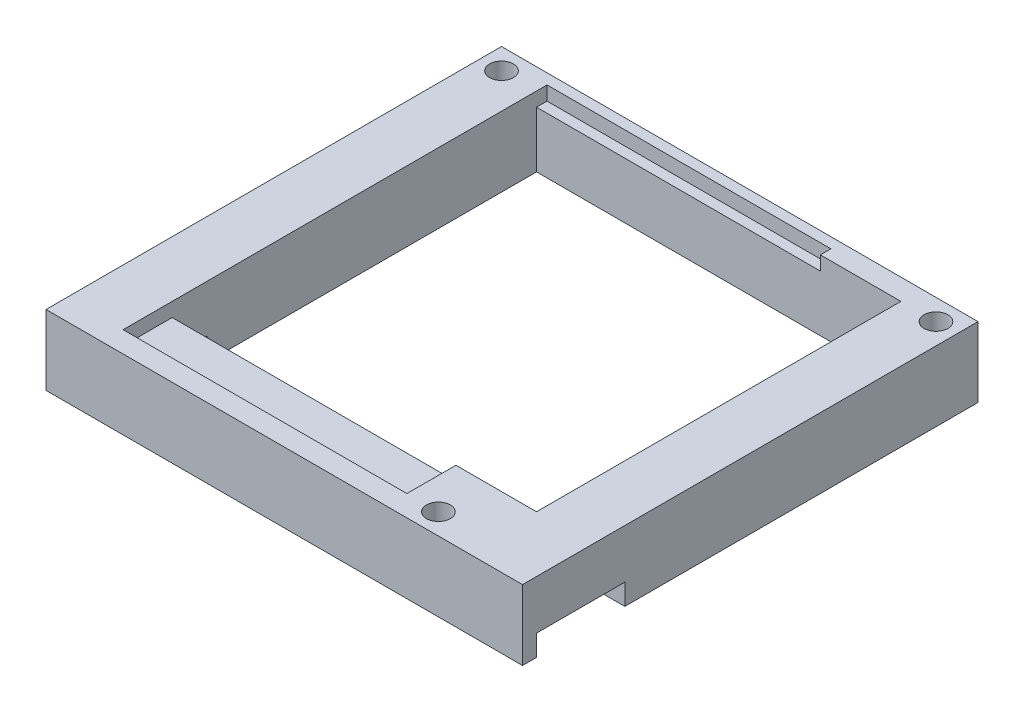
ISO-10303-21;
HEADER;
FILE_DESCRIPTION(('STEP AP214'),'2;1');
FILE_NAME('part.step','',(''),(''),'','','');
FILE_SCHEMA(('AUTOMOTIVE_DESIGN { 1 0 10303 214 1 1 1 1 }'));
ENDSEC;
DATA;
#1=APPLICATION_CONTEXT('core data for automotive mechanical design processes');
#2=APPLICATION_PROTOCOL_DEFINITION('international standard','automotive_design',2000,#1);
#3=PRODUCT_CONTEXT('',#1,'mechanical');
#4=PRODUCT('Part','Part','',(#3));
#5=PRODUCT_RELATED_PRODUCT_CATEGORY('part','',(#4));
#6=PRODUCT_DEFINITION_FORMATION('','',#4);
#7=PRODUCT_DEFINITION_CONTEXT('part definition',#1,'design');
#8=PRODUCT_DEFINITION('design','',#6,#7);
#9=PRODUCT_DEFINITION_SHAPE('','',#8);
#10=(LENGTH_UNIT() NAMED_UNIT(*) SI_UNIT(.MILLI.,.METRE.));
#11=(NAMED_UNIT(*) PLANE_ANGLE_UNIT() SI_UNIT($,.RADIAN.));
#12=(NAMED_UNIT(*) SI_UNIT($,.STERADIAN.) SOLID_ANGLE_UNIT());
#13=UNCERTAINTY_MEASURE_WITH_UNIT(LENGTH_MEASURE(1.E-05),#10,'distance_accuracy_value','');
#14=(GEOMETRIC_REPRESENTATION_CONTEXT(3) GLOBAL_UNCERTAINTY_ASSIGNED_CONTEXT((#13)) GLOBAL_UNIT_ASSIGNED_CONTEXT((#10,
#11,#12)) REPRESENTATION_CONTEXT('',''));
#15=CARTESIAN_POINT('',(0.,0.,0.));
#16=DIRECTION('',(0.,0.,1.));
#17=DIRECTION('',(1.,0.,0.));
#18=AXIS2_PLACEMENT_3D('',#15,#16,#17);
#19=CARTESIAN_POINT('',(-39.6988745927811,7.84894881770015,90.4869749490172));
#20=DIRECTION('',(0.,-1.,0.));
#21=DIRECTION('',(0.,0.,-1.));
#22=AXIS2_PLACEMENT_3D('',#19,#20,#21);
#23=PLANE('',#22);
#24=DIRECTION('',(1.,0.,0.));
#25=VECTOR('',#24,1.);
#26=CARTESIAN_POINT('',(28.3011254072189,7.84894881770015,75.8869749490172));
#27=LINE('',#26,#25);
#28=CARTESIAN_POINT('',(20.3011254072189,7.84894881770015,75.8869749490172));
#29=VERTEX_POINT('',#28);
#30=CARTESIAN_POINT('',(28.3011254072189,7.84894881770015,75.8869749490172));
#31=VERTEX_POINT('',#30);
#32=EDGE_CURVE('E228',#29,#31,#27,.T.);
#33=ORIENTED_EDGE('',*,*,#32,.F.);
#34=DIRECTION('',(0.,0.,-1.));
#35=VECTOR('',#34,1.);
#36=CARTESIAN_POINT('',(20.3011254072189,7.84894881770015,80.4869749490172));
#37=LINE('',#36,#35);
#38=CARTESIAN_POINT('',(20.3011254072189,7.84894881770015,28.4869749490172));
#39=VERTEX_POINT('',#38);
#40=EDGE_CURVE('E384',#29,#39,#37,.T.);
#41=ORIENTED_EDGE('',*,*,#40,.T.);
#42=DIRECTION('',(-1.,0.,0.));
#43=VECTOR('',#42,1.);
#44=CARTESIAN_POINT('',(-31.6988745927811,7.84894881770015,28.4869749490172));
#45=LINE('',#44,#43);
#46=CARTESIAN_POINT('',(-31.6988745927811,7.84894881770015,28.4869749490172));
#47=VERTEX_POINT('',#46);
#48=EDGE_CURVE('E370',#39,#47,#45,.T.);
#49=ORIENTED_EDGE('',*,*,#48,.T.);
#50=DIRECTION('',(0.,0.,1.));
#51=VECTOR('',#50,1.);
#52=CARTESIAN_POINT('',(-31.6988745927811,7.84894881770015,80.4869749490172));
#53=LINE('',#52,#51);
#54=CARTESIAN_POINT('',(-31.6988745927811,7.84894881770015,75.4869749490172));
#55=VERTEX_POINT('',#54);
#56=EDGE_CURVE('E366',#47,#55,#53,.T.);
#57=ORIENTED_EDGE('',*,*,#56,.T.);
#58=DIRECTION('',(-1.,0.,0.));
#59=VECTOR('',#58,1.);
#60=CARTESIAN_POINT('',(-3.69887459278107,7.84894881770015,75.4869749490172));
#61=LINE('',#60,#59);
#62=CARTESIAN_POINT('',(-33.6988745927811,7.84894881770015,75.4869749490172));
#63=VERTEX_POINT('',#62);
#64=EDGE_CURVE('E254',#55,#63,#61,.T.);
#65=ORIENTED_EDGE('',*,*,#64,.T.);
#66=DIRECTION('',(0.,0.,1.));
#67=VECTOR('',#66,1.);
#68=CARTESIAN_POINT('',(-33.6988745927811,7.84894881770015,74.4869749490172));
#69=LINE('',#68,#67);
#70=CARTESIAN_POINT('',(-33.6988745927811,7.84894881770015,74.4869749490172));
#71=VERTEX_POINT('',#70);
#72=EDGE_CURVE('E268',#71,#63,#69,.T.);
#73=ORIENTED_EDGE('',*,*,#72,.F.);
#74=DIRECTION('',(-1.,0.,0.));
#75=VECTOR('',#74,1.);
#76=CARTESIAN_POINT('',(-33.6988745927811,7.84894881770015,74.4869749490172));
#77=LINE('',#76,#75);
#78=CARTESIAN_POINT('',(-39.6988745927811,7.84894881770015,74.4869749490172));
#79=VERTEX_POINT('',#78);
#80=EDGE_CURVE('E298',#71,#79,#77,.T.);
#81=ORIENTED_EDGE('',*,*,#80,.T.);
#82=DIRECTION('',(0.,0.,1.));
#83=VECTOR('',#82,1.);
#84=CARTESIAN_POINT('',(-39.6988745927811,7.84894881770015,90.4869749490172));
#85=LINE('',#84,#83);
#86=CARTESIAN_POINT('',(-39.6988745927811,7.84894881770015,25.4869749490172));
#87=VERTEX_POINT('',#86);
#88=EDGE_CURVE('E410',#87,#79,#85,.T.);
#89=ORIENTED_EDGE('',*,*,#88,.F.);
#90=DIRECTION('',(-1.,0.,0.));
#91=VECTOR('',#90,1.);
#92=CARTESIAN_POINT('',(-39.6988745927811,7.84894881770015,25.4869749490172));
#93=LINE('',#92,#91);
#94=CARTESIAN_POINT('',(28.3011254072189,7.84894881770015,25.4869749490172));
#95=VERTEX_POINT('',#94);
#96=EDGE_CURVE('E403',#95,#87,#93,.T.);
#97=ORIENTED_EDGE('',*,*,#96,.F.);
#98=DIRECTION('',(0.,0.,-1.));
#99=VECTOR('',#98,1.);
#100=CARTESIAN_POINT('',(28.3011254072189,7.84894881770015,90.4869749490172));
#101=LINE('',#100,#99);
#102=EDGE_CURVE('E415',#31,#95,#101,.T.);
#103=ORIENTED_EDGE('',*,*,#102,.F.);
#104=EDGE_LOOP('',(#33,#41,#49,#57,#65,#73,#81,#89,#97,#103));
#105=FACE_BOUND('',#104,.T.);
#106=CARTESIAN_POINT('',(25.3011254072189,7.84894881770015,28.4869749490172));
#107=DIRECTION('',(0.,1.,0.));
#108=DIRECTION('',(0.,0.,1.));
#109=AXIS2_PLACEMENT_3D('',#106,#107,#108);
#110=CIRCLE('',#109,1.7);
#111=CARTESIAN_POINT('',(25.3011254072189,7.84894881770015,30.1869749490172));
#112=VERTEX_POINT('',#111);
#113=EDGE_CURVE('E318',#112,#112,#110,.T.);
#114=ORIENTED_EDGE('',*,*,#113,.T.);
#115=EDGE_LOOP('',(#114));
#116=FACE_BOUND('',#115,.T.);
#117=CARTESIAN_POINT('',(-36.6988745927811,7.84894881770015,28.4869749490172));
#118=DIRECTION('',(0.,1.,0.));
#119=DIRECTION('',(0.,0.,1.));
#120=AXIS2_PLACEMENT_3D('',#117,#118,#119);
#121=CIRCLE('',#120,1.70000000000001);
#122=CARTESIAN_POINT('',(-36.6988745927811,7.84894881770015,30.1869749490172));
#123=VERTEX_POINT('',#122);
#124=EDGE_CURVE('E311',#123,#123,#121,.T.);
#125=ORIENTED_EDGE('',*,*,#124,.T.);
#126=EDGE_LOOP('',(#125));
#127=FACE_BOUND('',#126,.T.);
#128=ADVANCED_FACE('F16',(#105,#116,#127),#23,.T.);
#129=CARTESIAN_POINT('',(-33.6988745927811,7.84894881770015,90.4869749490172));
#130=DIRECTION('',(-1.,0.,0.));
#131=DIRECTION('',(0.,0.,1.));
#132=AXIS2_PLACEMENT_3D('',#129,#130,#131);
#133=PLANE('',#132);
#134=DIRECTION('',(0.,-1.,0.));
#135=VECTOR('',#134,1.);
#136=CARTESIAN_POINT('',(-33.6988745927811,7.84894881770015,75.4869749490172));
#137=LINE('',#136,#135);
#138=CARTESIAN_POINT('',(-33.6988745927811,11.0989488177001,75.4869749490172));
#139=VERTEX_POINT('',#138);
#140=EDGE_CURVE('E251',#139,#63,#137,.T.);
#141=ORIENTED_EDGE('',*,*,#140,.F.);
#142=DIRECTION('',(0.,0.,-1.));
#143=VECTOR('',#142,1.);
#144=CARTESIAN_POINT('',(-33.6988745927811,11.0989488177001,81.5869749490172));
#145=LINE('',#144,#143);
#146=CARTESIAN_POINT('',(-33.6988745927811,11.0989488177001,74.4869749490172));
#147=VERTEX_POINT('',#146);
#148=EDGE_CURVE('E280',#139,#147,#145,.T.);
#149=ORIENTED_EDGE('',*,*,#148,.T.);
#150=DIRECTION('',(0.,-1.,0.));
#151=VECTOR('',#150,1.);
#152=CARTESIAN_POINT('',(-33.6988745927811,11.0989488177001,74.4869749490172));
#153=LINE('',#152,#151);
#154=EDGE_CURVE('E282',#147,#71,#153,.T.);
#155=ORIENTED_EDGE('',*,*,#154,.T.);
#156=ORIENTED_EDGE('',*,*,#72,.T.);
#157=EDGE_LOOP('',(#141,#149,#155,#156));
#158=FACE_BOUND('',#157,.T.);
#159=ADVANCED_FACE('F517',(#158),#133,.T.);
#160=CARTESIAN_POINT('',(-39.6988745927811,17.8489488177001,90.4869749490172));
#161=DIRECTION('',(0.,-1.,0.));
#162=DIRECTION('',(0.,0.,-1.));
#163=AXIS2_PLACEMENT_3D('',#160,#161,#162);
#164=PLANE('',#163);
#165=CARTESIAN_POINT('',(-36.6988745927811,17.8489488177001,28.4869749490172));
#166=DIRECTION('',(0.,1.,0.));
#167=DIRECTION('',(0.,0.,1.));
#168=AXIS2_PLACEMENT_3D('',#165,#166,#167);
#169=CIRCLE('',#168,1.70000000000001);
#170=CARTESIAN_POINT('',(-36.6988745927811,17.8489488177001,30.1869749490172));
#171=VERTEX_POINT('',#170);
#172=EDGE_CURVE('E315',#171,#171,#169,.T.);
#173=ORIENTED_EDGE('',*,*,#172,.F.);
#174=EDGE_LOOP('',(#173));
#175=FACE_BOUND('',#174,.T.);
#176=CARTESIAN_POINT('',(25.3011254072189,17.8489488177001,28.4869749490172));
#177=DIRECTION('',(0.,1.,0.));
#178=DIRECTION('',(0.,0.,1.));
#179=AXIS2_PLACEMENT_3D('',#176,#177,#178);
#180=CIRCLE('',#179,1.7);
#181=CARTESIAN_POINT('',(25.3011254072189,17.8489488177001,30.1869749490172));
#182=VERTEX_POINT('',#181);
#183=EDGE_CURVE('E321',#182,#182,#180,.T.);
#184=ORIENTED_EDGE('',*,*,#183,.F.);
#185=EDGE_LOOP('',(#184));
#186=FACE_BOUND('',#185,.T.);
#187=CARTESIAN_POINT('',(13.3011254072189,17.8489488177001,87.4869749490172));
#188=DIRECTION('',(0.,1.,0.));
#189=DIRECTION('',(0.,0.,1.));
#190=AXIS2_PLACEMENT_3D('',#187,#188,#189);
#191=CIRCLE('',#190,1.7);
#192=CARTESIAN_POINT('',(13.3011254072189,17.8489488177001,89.1869749490172));
#193=VERTEX_POINT('',#192);
#194=EDGE_CURVE('E301',#193,#193,#191,.T.);
#195=ORIENTED_EDGE('',*,*,#194,.F.);
#196=EDGE_LOOP('',(#195));
#197=FACE_BOUND('',#196,.T.);
#198=DIRECTION('',(0.,0.,1.));
#199=VECTOR('',#198,1.);
#200=CARTESIAN_POINT('',(-39.6988745927811,17.8489488177001,90.4869749490172));
#201=LINE('',#200,#199);
#202=CARTESIAN_POINT('',(-39.6988745927811,17.8489488177001,25.4869749490172));
#203=VERTEX_POINT('',#202);
#204=CARTESIAN_POINT('',(-39.6988745927811,17.8489488177001,90.4869749490172));
#205=VERTEX_POINT('',#204);
#206=EDGE_CURVE('E399',#203,#205,#201,.T.);
#207=ORIENTED_EDGE('',*,*,#206,.T.);
#208=DIRECTION('',(1.,0.,0.));
#209=VECTOR('',#208,1.);
#210=CARTESIAN_POINT('',(-39.6988745927811,17.8489488177001,90.4869749490172));
#211=LINE('',#210,#209);
#212=CARTESIAN_POINT('',(28.3011254072189,17.8489488177001,90.4869749490172));
#213=VERTEX_POINT('',#212);
#214=EDGE_CURVE('E402',#205,#213,#211,.T.);
#215=ORIENTED_EDGE('',*,*,#214,.T.);
#216=DIRECTION('',(0.,0.,-1.));
#217=VECTOR('',#216,1.);
#218=CARTESIAN_POINT('',(28.3011254072189,17.8489488177001,90.4869749490172));
#219=LINE('',#218,#217);
#220=CARTESIAN_POINT('',(28.3011254072189,17.8489488177001,25.4869749490172));
#221=VERTEX_POINT('',#220);
#222=EDGE_CURVE('E405',#213,#221,#219,.T.);
#223=ORIENTED_EDGE('',*,*,#222,.T.);
#224=DIRECTION('',(-1.,0.,0.));
#225=VECTOR('',#224,1.);
#226=CARTESIAN_POINT('',(-39.6988745927811,17.8489488177001,25.4869749490172));
#227=LINE('',#226,#225);
#228=EDGE_CURVE('E407',#221,#203,#227,.T.);
#229=ORIENTED_EDGE('',*,*,#228,.T.);
#230=EDGE_LOOP('',(#207,#215,#223,#229));
#231=FACE_BOUND('',#230,.T.);
#232=DIRECTION('',(0.,0.,1.));
#233=VECTOR('',#232,1.);
#234=CARTESIAN_POINT('',(-31.6988745927811,17.8489488177001,80.4869749490172));
#235=LINE('',#234,#233);
#236=CARTESIAN_POINT('',(-31.6988745927811,17.8489488177001,26.9869749490172));
#237=VERTEX_POINT('',#236);
#238=CARTESIAN_POINT('',(-31.6988745927811,17.8489488177001,87.4869749490172));
#239=VERTEX_POINT('',#238);
#240=EDGE_CURVE('E367',#237,#239,#235,.T.);
#241=ORIENTED_EDGE('',*,*,#240,.F.);
#242=DIRECTION('',(-1.,0.,0.));
#243=VECTOR('',#242,1.);
#244=CARTESIAN_POINT('',(-31.6988745927811,17.8489488177001,26.9869749490172));
#245=LINE('',#244,#243);
#246=CARTESIAN_POINT('',(8.80112540721892,17.8489488177001,26.9869749490172));
#247=VERTEX_POINT('',#246);
#248=EDGE_CURVE('E347',#247,#237,#245,.T.);
#249=ORIENTED_EDGE('',*,*,#248,.F.);
#250=DIRECTION('',(0.,0.,-1.));
#251=VECTOR('',#250,1.);
#252=CARTESIAN_POINT('',(8.80112540721892,17.8489488177001,26.9869749490172));
#253=LINE('',#252,#251);
#254=CARTESIAN_POINT('',(8.80112540721892,17.8489488177001,28.4869749490172));
#255=VERTEX_POINT('',#254);
#256=EDGE_CURVE('E344',#255,#247,#253,.T.);
#257=ORIENTED_EDGE('',*,*,#256,.F.);
#258=DIRECTION('',(-1.,0.,0.));
#259=VECTOR('',#258,1.);
#260=CARTESIAN_POINT('',(-31.6988745927811,17.8489488177001,28.4869749490172));
#261=LINE('',#260,#259);
#262=CARTESIAN_POINT('',(20.3011254072189,17.8489488177001,28.4869749490172));
#263=VERTEX_POINT('',#262);
#264=EDGE_CURVE('E375',#263,#255,#261,.T.);
#265=ORIENTED_EDGE('',*,*,#264,.F.);
#266=DIRECTION('',(0.,0.,-1.));
#267=VECTOR('',#266,1.);
#268=CARTESIAN_POINT('',(20.3011254072189,17.8489488177001,80.4869749490172));
#269=LINE('',#268,#267);
#270=CARTESIAN_POINT('',(20.3011254072189,17.8489488177001,80.4869749490172));
#271=VERTEX_POINT('',#270);
#272=EDGE_CURVE('E372',#271,#263,#269,.T.);
#273=ORIENTED_EDGE('',*,*,#272,.F.);
#274=DIRECTION('',(1.,0.,0.));
#275=VECTOR('',#274,1.);
#276=CARTESIAN_POINT('',(-31.6988745927811,17.8489488177001,80.4869749490172));
#277=LINE('',#276,#275);
#278=CARTESIAN_POINT('',(8.80112540721893,17.8489488177001,80.4869749490172));
#279=VERTEX_POINT('',#278);
#280=EDGE_CURVE('E369',#279,#271,#277,.T.);
#281=ORIENTED_EDGE('',*,*,#280,.F.);
#282=CARTESIAN_POINT('',(8.80112540721893,17.8489488177001,87.4869749490172));
#283=VERTEX_POINT('',#282);
#284=EDGE_CURVE('E345',#283,#279,#253,.T.);
#285=ORIENTED_EDGE('',*,*,#284,.F.);
#286=DIRECTION('',(1.,0.,0.));
#287=VECTOR('',#286,1.);
#288=CARTESIAN_POINT('',(-31.6988745927811,17.8489488177001,87.4869749490172));
#289=LINE('',#288,#287);
#290=EDGE_CURVE('E314',#239,#283,#289,.T.);
#291=ORIENTED_EDGE('',*,*,#290,.F.);
#292=EDGE_LOOP('',(#241,#249,#257,#265,#273,#281,#285,#291));
#293=FACE_BOUND('',#292,.T.);
#294=ADVANCED_FACE('F466',(#175,#186,#197,#231,#293),#164,.F.);
#295=DIRECTION('',(-1.,0.,0.));
#296=VECTOR('',#295,1.);
#297=CARTESIAN_POINT('',(20.3011254072189,7.84894881770015,88.4869749490172));
#298=LINE('',#297,#296);
#299=CARTESIAN_POINT('',(28.3011254072189,7.84894881770015,88.4869749490172));
#300=VERTEX_POINT('',#299);
#301=CARTESIAN_POINT('',(20.3011254072189,7.84894881770015,88.4869749490172));
#302=VERTEX_POINT('',#301);
#303=EDGE_CURVE('E214',#300,#302,#298,.T.);
#304=ORIENTED_EDGE('',*,*,#303,.F.);
#305=CARTESIAN_POINT('',(28.3011254072189,7.84894881770015,90.4869749490172));
#306=VERTEX_POINT('',#305);
#307=EDGE_CURVE('E416',#306,#300,#101,.T.);
#308=ORIENTED_EDGE('',*,*,#307,.F.);
#309=DIRECTION('',(1.,0.,0.));
#310=VECTOR('',#309,1.);
#311=CARTESIAN_POINT('',(-39.6988745927811,7.84894881770015,90.4869749490172));
#312=LINE('',#311,#310);
#313=CARTESIAN_POINT('',(-39.6988745927811,7.84894881770015,90.4869749490172));
#314=VERTEX_POINT('',#313);
#315=EDGE_CURVE('E413',#314,#306,#312,.T.);
#316=ORIENTED_EDGE('',*,*,#315,.F.);
#317=CARTESIAN_POINT('',(-39.6988745927811,7.84894881770015,88.4869749490172));
#318=VERTEX_POINT('',#317);
#319=EDGE_CURVE('E398',#318,#314,#85,.T.);
#320=ORIENTED_EDGE('',*,*,#319,.F.);
#321=DIRECTION('',(-1.,0.,0.));
#322=VECTOR('',#321,1.);
#323=CARTESIAN_POINT('',(-33.6988745927811,7.84894881770015,88.4869749490172));
#324=LINE('',#323,#322);
#325=CARTESIAN_POINT('',(-17.5552810533323,7.84894881770015,88.4869749490172));
#326=VERTEX_POINT('',#325);
#327=EDGE_CURVE('E285',#326,#318,#324,.T.);
#328=ORIENTED_EDGE('',*,*,#327,.F.);
#329=DIRECTION('',(0.866025403784442,0.,-0.499999999999995));
#330=VECTOR('',#329,1.);
#331=CARTESIAN_POINT('',(-3.69887459278107,7.84894881770015,80.4869749490172));
#332=LINE('',#331,#330);
#333=CARTESIAN_POINT('',(-3.69887459278107,7.84894881770015,80.4869749490172));
#334=VERTEX_POINT('',#333);
#335=EDGE_CURVE('E11',#326,#334,#332,.T.);
#336=ORIENTED_EDGE('',*,*,#335,.T.);
#337=DIRECTION('',(1.,0.,0.));
#338=VECTOR('',#337,1.);
#339=CARTESIAN_POINT('',(-31.6988745927811,7.84894881770015,80.4869749490172));
#340=LINE('',#339,#338);
#341=CARTESIAN_POINT('',(12.301125407219,7.84894881770015,80.4869749490172));
#342=VERTEX_POINT('',#341);
#343=EDGE_CURVE('E381',#334,#342,#340,.T.);
#344=ORIENTED_EDGE('',*,*,#343,.T.);
#345=DIRECTION('',(-0.707106781186546,0.,-0.707106781186549));
#346=VECTOR('',#345,1.);
#347=CARTESIAN_POINT('',(12.301125407219,7.84894881770015,80.4869749490172));
#348=LINE('',#347,#346);
#349=EDGE_CURVE('E230',#302,#342,#348,.T.);
#350=ORIENTED_EDGE('',*,*,#349,.F.);
#351=EDGE_LOOP('',(#304,#308,#316,#320,#328,#336,#344,#350));
#352=FACE_BOUND('',#351,.T.);
#353=CARTESIAN_POINT('',(13.3011254072189,7.84894881770015,87.4869749490172));
#354=DIRECTION('',(0.,1.,0.));
#355=DIRECTION('',(0.,0.,1.));
#356=AXIS2_PLACEMENT_3D('',#353,#354,#355);
#357=CIRCLE('',#356,1.7);
#358=CARTESIAN_POINT('',(13.3011254072189,7.84894881770015,89.1869749490172));
#359=VERTEX_POINT('',#358);
#360=EDGE_CURVE('E324',#359,#359,#357,.T.);
#361=ORIENTED_EDGE('',*,*,#360,.T.);
#362=EDGE_LOOP('',(#361));
#363=FACE_BOUND('',#362,.T.);
#364=ADVANCED_FACE('F452',(#352,#363),#23,.T.);
#365=CARTESIAN_POINT('',(-39.6988745927811,17.8489488177001,90.4869749490172));
#366=DIRECTION('',(1.,0.,0.));
#367=DIRECTION('',(0.,0.,-1.));
#368=AXIS2_PLACEMENT_3D('',#365,#366,#367);
#369=PLANE('',#368);
#370=ORIENTED_EDGE('',*,*,#88,.T.);
#371=DIRECTION('',(0.,-1.,0.));
#372=VECTOR('',#371,1.);
#373=CARTESIAN_POINT('',(-39.6988745927811,11.0989488177001,74.4869749490172));
#374=LINE('',#373,#372);
#375=CARTESIAN_POINT('',(-39.6988745927811,11.0989488177001,74.4869749490172));
#376=VERTEX_POINT('',#375);
#377=EDGE_CURVE('E272',#376,#79,#374,.T.);
#378=ORIENTED_EDGE('',*,*,#377,.F.);
#379=DIRECTION('',(0.,0.,-1.));
#380=VECTOR('',#379,1.);
#381=CARTESIAN_POINT('',(-39.6988745927811,11.0989488177001,81.5869749490172));
#382=LINE('',#381,#380);
#383=CARTESIAN_POINT('',(-39.6988745927811,11.0989488177001,81.5869749490172));
#384=VERTEX_POINT('',#383);
#385=EDGE_CURVE('E294',#384,#376,#382,.T.);
#386=ORIENTED_EDGE('',*,*,#385,.F.);
#387=DIRECTION('',(0.,-0.563336824641508,-0.826227342807549));
#388=VECTOR('',#387,1.);
#389=CARTESIAN_POINT('',(-39.6988745927811,11.8489488177001,82.6869749490172));
#390=LINE('',#389,#388);
#391=CARTESIAN_POINT('',(-39.6988745927811,11.8489488177001,82.6869749490172));
#392=VERTEX_POINT('',#391);
#393=EDGE_CURVE('E291',#392,#384,#390,.T.);
#394=ORIENTED_EDGE('',*,*,#393,.F.);
#395=DIRECTION('',(0.,0.,-1.));
#396=VECTOR('',#395,1.);
#397=CARTESIAN_POINT('',(-39.6988745927811,11.8489488177001,88.4869749490172));
#398=LINE('',#397,#396);
#399=CARTESIAN_POINT('',(-39.6988745927811,11.8489488177001,88.4869749490172));
#400=VERTEX_POINT('',#399);
#401=EDGE_CURVE('E288',#400,#392,#398,.T.);
#402=ORIENTED_EDGE('',*,*,#401,.F.);
#403=DIRECTION('',(0.,1.,0.));
#404=VECTOR('',#403,1.);
#405=CARTESIAN_POINT('',(-39.6988745927811,7.84894881770015,88.4869749490172));
#406=LINE('',#405,#404);
#407=EDGE_CURVE('E267',#318,#400,#406,.T.);
#408=ORIENTED_EDGE('',*,*,#407,.F.);
#409=ORIENTED_EDGE('',*,*,#319,.T.);
#410=DIRECTION('',(0.,-1.,0.));
#411=VECTOR('',#410,1.);
#412=CARTESIAN_POINT('',(-39.6988745927811,17.8489488177001,90.4869749490172));
#413=LINE('',#412,#411);
#414=EDGE_CURVE('E428',#205,#314,#413,.T.);
#415=ORIENTED_EDGE('',*,*,#414,.F.);
#416=ORIENTED_EDGE('',*,*,#206,.F.);
#417=DIRECTION('',(0.,-1.,0.));
#418=VECTOR('',#417,1.);
#419=CARTESIAN_POINT('',(-39.6988745927811,17.8489488177001,25.4869749490172));
#420=LINE('',#419,#418);
#421=EDGE_CURVE('E409',#203,#87,#420,.T.);
#422=ORIENTED_EDGE('',*,*,#421,.T.);
#423=EDGE_LOOP('',(#370,#378,#386,#394,#402,#408,#409,#415,#416,#422));
#424=FACE_BOUND('',#423,.T.);
#425=ADVANCED_FACE('F493',(#424),#369,.F.);
#426=CARTESIAN_POINT('',(-39.6988745927811,17.8489488177001,90.4869749490172));
#427=DIRECTION('',(0.,0.,-1.));
#428=DIRECTION('',(-1.,0.,0.));
#429=AXIS2_PLACEMENT_3D('',#426,#427,#428);
#430=PLANE('',#429);
#431=ORIENTED_EDGE('',*,*,#315,.T.);
#432=DIRECTION('',(0.,-1.,0.));
#433=VECTOR('',#432,1.);
#434=CARTESIAN_POINT('',(28.3011254072189,17.8489488177001,90.4869749490172));
#435=LINE('',#434,#433);
#436=EDGE_CURVE('E425',#213,#306,#435,.T.);
#437=ORIENTED_EDGE('',*,*,#436,.F.);
#438=ORIENTED_EDGE('',*,*,#214,.F.);
#439=ORIENTED_EDGE('',*,*,#414,.T.);
#440=EDGE_LOOP('',(#431,#437,#438,#439));
#441=FACE_BOUND('',#440,.T.);
#442=ADVANCED_FACE('F490',(#441),#430,.F.);
#443=CARTESIAN_POINT('',(28.3011254072189,17.8489488177001,90.4869749490172));
#444=DIRECTION('',(-1.,0.,0.));
#445=DIRECTION('',(0.,0.,1.));
#446=AXIS2_PLACEMENT_3D('',#443,#444,#445);
#447=PLANE('',#446);
#448=ORIENTED_EDGE('',*,*,#307,.T.);
#449=DIRECTION('',(0.,-1.,0.));
#450=VECTOR('',#449,1.);
#451=CARTESIAN_POINT('',(28.3011254072189,10.8489488177001,88.4869749490172));
#452=LINE('',#451,#450);
#453=CARTESIAN_POINT('',(28.3011254072189,10.8489488177001,88.4869749490172));
#454=VERTEX_POINT('',#453);
#455=EDGE_CURVE('E241',#454,#300,#452,.T.);
#456=ORIENTED_EDGE('',*,*,#455,.F.);
#457=DIRECTION('',(0.,0.,1.));
#458=VECTOR('',#457,1.);
#459=CARTESIAN_POINT('',(28.3011254072189,10.8489488177001,88.4869749490172));
#460=LINE('',#459,#458);
#461=CARTESIAN_POINT('',(28.3011254072189,10.8489488177001,75.8869749490172));
#462=VERTEX_POINT('',#461);
#463=EDGE_CURVE('E218',#462,#454,#460,.T.);
#464=ORIENTED_EDGE('',*,*,#463,.F.);
#465=DIRECTION('',(0.,-1.,0.));
#466=VECTOR('',#465,1.);
#467=CARTESIAN_POINT('',(28.3011254072189,10.8489488177001,75.8869749490172));
#468=LINE('',#467,#466);
#469=EDGE_CURVE('E244',#462,#31,#468,.T.);
#470=ORIENTED_EDGE('',*,*,#469,.T.);
#471=ORIENTED_EDGE('',*,*,#102,.T.);
#472=DIRECTION('',(0.,-1.,0.));
#473=VECTOR('',#472,1.);
#474=CARTESIAN_POINT('',(28.3011254072189,17.8489488177001,25.4869749490172));
#475=LINE('',#474,#473);
#476=EDGE_CURVE('E422',#221,#95,#475,.T.);
#477=ORIENTED_EDGE('',*,*,#476,.F.);
#478=ORIENTED_EDGE('',*,*,#222,.F.);
#479=ORIENTED_EDGE('',*,*,#436,.T.);
#480=EDGE_LOOP('',(#448,#456,#464,#470,#471,#477,#478,#479));
#481=FACE_BOUND('',#480,.T.);
#482=ADVANCED_FACE('F483',(#481),#447,.F.);
#483=CARTESIAN_POINT('',(-39.6988745927811,17.8489488177001,25.4869749490172));
#484=DIRECTION('',(0.,0.,1.));
#485=DIRECTION('',(1.,0.,0.));
#486=AXIS2_PLACEMENT_3D('',#483,#484,#485);
#487=PLANE('',#486);
#488=ORIENTED_EDGE('',*,*,#96,.T.);
#489=ORIENTED_EDGE('',*,*,#421,.F.);
#490=ORIENTED_EDGE('',*,*,#228,.F.);
#491=ORIENTED_EDGE('',*,*,#476,.T.);
#492=EDGE_LOOP('',(#488,#489,#490,#491));
#493=FACE_BOUND('',#492,.T.);
#494=ADVANCED_FACE('F582',(#493),#487,.F.);
#495=CARTESIAN_POINT('',(-31.6988745927811,17.8489488177001,80.4869749490172));
#496=DIRECTION('',(1.,0.,0.));
#497=DIRECTION('',(0.,0.,-1.));
#498=AXIS2_PLACEMENT_3D('',#495,#496,#497);
#499=PLANE('',#498);
#500=DIRECTION('',(0.,1.,0.));
#501=VECTOR('',#500,1.);
#502=CARTESIAN_POINT('',(-31.6988745927811,17.8489488177001,75.4869749490172));
#503=LINE('',#502,#501);
#504=CARTESIAN_POINT('',(-31.6988745927811,11.0989488177001,75.4869749490172));
#505=VERTEX_POINT('',#504);
#506=EDGE_CURVE('E265',#55,#505,#503,.T.);
#507=ORIENTED_EDGE('',*,*,#506,.F.);
#508=ORIENTED_EDGE('',*,*,#56,.F.);
#509=DIRECTION('',(0.,-1.,0.));
#510=VECTOR('',#509,1.);
#511=CARTESIAN_POINT('',(-31.6988745927811,17.8489488177001,28.4869749490172));
#512=LINE('',#511,#510);
#513=CARTESIAN_POINT('',(-31.6988745927811,15.8489488177001,28.4869749490172));
#514=VERTEX_POINT('',#513);
#515=EDGE_CURVE('E378',#514,#47,#512,.T.);
#516=ORIENTED_EDGE('',*,*,#515,.F.);
#517=DIRECTION('',(0.,0.,1.));
#518=VECTOR('',#517,1.);
#519=CARTESIAN_POINT('',(-31.6988745927811,15.8489488177001,26.9869749490172));
#520=LINE('',#519,#518);
#521=CARTESIAN_POINT('',(-31.6988745927811,15.8489488177001,26.9869749490172));
#522=VERTEX_POINT('',#521);
#523=EDGE_CURVE('E329',#522,#514,#520,.T.);
#524=ORIENTED_EDGE('',*,*,#523,.F.);
#525=DIRECTION('',(0.,1.,0.));
#526=VECTOR('',#525,1.);
#527=CARTESIAN_POINT('',(-31.6988745927811,15.8489488177001,26.9869749490172));
#528=LINE('',#527,#526);
#529=EDGE_CURVE('E350',#522,#237,#528,.T.);
#530=ORIENTED_EDGE('',*,*,#529,.T.);
#531=ORIENTED_EDGE('',*,*,#240,.T.);
#532=DIRECTION('',(0.,1.,0.));
#533=VECTOR('',#532,1.);
#534=CARTESIAN_POINT('',(-31.6988745927811,15.8489488177001,87.4869749490172));
#535=LINE('',#534,#533);
#536=CARTESIAN_POINT('',(-31.6988745927811,15.8489488177001,87.4869749490172));
#537=VERTEX_POINT('',#536);
#538=EDGE_CURVE('E341',#537,#239,#535,.T.);
#539=ORIENTED_EDGE('',*,*,#538,.F.);
#540=CARTESIAN_POINT('',(-31.6988745927811,15.8489488177001,80.4869749490172));
#541=VERTEX_POINT('',#540);
#542=EDGE_CURVE('E332',#541,#537,#520,.T.);
#543=ORIENTED_EDGE('',*,*,#542,.F.);
#544=DIRECTION('',(0.,-1.,0.));
#545=VECTOR('',#544,1.);
#546=CARTESIAN_POINT('',(-31.6988745927811,17.8489488177001,80.4869749490172));
#547=LINE('',#546,#545);
#548=CARTESIAN_POINT('',(-31.6988745927811,11.0989488177001,80.4869749490172));
#549=VERTEX_POINT('',#548);
#550=EDGE_CURVE('E395',#541,#549,#547,.T.);
#551=ORIENTED_EDGE('',*,*,#550,.T.);
#552=DIRECTION('',(0.,0.,1.));
#553=VECTOR('',#552,1.);
#554=CARTESIAN_POINT('',(-31.6988745927811,11.0989488177001,80.4869749490172));
#555=LINE('',#554,#553);
#556=EDGE_CURVE('E263',#505,#549,#555,.T.);
#557=ORIENTED_EDGE('',*,*,#556,.F.);
#558=EDGE_LOOP('',(#507,#508,#516,#524,#530,#531,#539,#543,#551,#557));
#559=FACE_BOUND('',#558,.T.);
#560=ADVANCED_FACE('F525',(#559),#499,.T.);
#561=CARTESIAN_POINT('',(-31.6988745927811,17.8489488177001,80.4869749490172));
#562=DIRECTION('',(0.,0.,-1.));
#563=DIRECTION('',(-1.,0.,0.));
#564=AXIS2_PLACEMENT_3D('',#561,#562,#563);
#565=PLANE('',#564);
#566=DIRECTION('',(0.,-1.,0.));
#567=VECTOR('',#566,1.);
#568=CARTESIAN_POINT('',(12.301125407219,10.8489488177001,80.4869749490172));
#569=LINE('',#568,#567);
#570=CARTESIAN_POINT('',(12.301125407219,10.8489488177001,80.4869749490172));
#571=VERTEX_POINT('',#570);
#572=EDGE_CURVE('E217',#571,#342,#569,.T.);
#573=ORIENTED_EDGE('',*,*,#572,.T.);
#574=ORIENTED_EDGE('',*,*,#343,.F.);
#575=DIRECTION('',(0.,1.,0.));
#576=VECTOR('',#575,1.);
#577=CARTESIAN_POINT('',(-3.69887459278107,17.8489488177001,80.4869749490172));
#578=LINE('',#577,#576);
#579=CARTESIAN_POINT('',(-3.69887459278107,11.0989488177001,80.4869749490172));
#580=VERTEX_POINT('',#579);
#581=EDGE_CURVE('E436',#334,#580,#578,.T.);
#582=ORIENTED_EDGE('',*,*,#581,.T.);
#583=DIRECTION('',(1.,0.,0.));
#584=VECTOR('',#583,1.);
#585=CARTESIAN_POINT('',(-31.6988745927811,11.0989488177001,80.4869749490172));
#586=LINE('',#585,#584);
#587=EDGE_CURVE('E257',#549,#580,#586,.T.);
#588=ORIENTED_EDGE('',*,*,#587,.F.);
#589=ORIENTED_EDGE('',*,*,#550,.F.);
#590=DIRECTION('',(1.,0.,0.));
#591=VECTOR('',#590,1.);
#592=CARTESIAN_POINT('',(-31.6988745927811,15.8489488177001,80.4869749490172));
#593=LINE('',#592,#591);
#594=CARTESIAN_POINT('',(8.80112540721893,15.8489488177001,80.4869749490172));
#595=VERTEX_POINT('',#594);
#596=EDGE_CURVE('E353',#541,#595,#593,.T.);
#597=ORIENTED_EDGE('',*,*,#596,.T.);
#598=DIRECTION('',(0.,-1.,0.));
#599=VECTOR('',#598,1.);
#600=CARTESIAN_POINT('',(8.80112540721893,17.8489488177001,80.4869749490172));
#601=LINE('',#600,#599);
#602=EDGE_CURVE('E363',#279,#595,#601,.T.);
#603=ORIENTED_EDGE('',*,*,#602,.F.);
#604=ORIENTED_EDGE('',*,*,#280,.T.);
#605=DIRECTION('',(0.,-1.,0.));
#606=VECTOR('',#605,1.);
#607=CARTESIAN_POINT('',(20.3011254072189,17.8489488177001,80.4869749490172));
#608=LINE('',#607,#606);
#609=CARTESIAN_POINT('',(20.3011254072189,10.8489488177001,80.4869749490172));
#610=VERTEX_POINT('',#609);
#611=EDGE_CURVE('E392',#271,#610,#608,.T.);
#612=ORIENTED_EDGE('',*,*,#611,.T.);
#613=DIRECTION('',(1.,0.,0.));
#614=VECTOR('',#613,1.);
#615=CARTESIAN_POINT('',(20.3011254072189,10.8489488177001,80.4869749490172));
#616=LINE('',#615,#614);
#617=EDGE_CURVE('E31',#571,#610,#616,.T.);
#618=ORIENTED_EDGE('',*,*,#617,.F.);
#619=EDGE_LOOP('',(#573,#574,#582,#588,#589,#597,#603,#604,#612,#618));
#620=FACE_BOUND('',#619,.T.);
#621=ADVANCED_FACE('F456',(#620),#565,.T.);
#622=CARTESIAN_POINT('',(20.3011254072189,17.8489488177001,80.4869749490172));
#623=DIRECTION('',(-1.,0.,0.));
#624=DIRECTION('',(0.,0.,1.));
#625=AXIS2_PLACEMENT_3D('',#622,#623,#624);
#626=PLANE('',#625);
#627=DIRECTION('',(0.,-1.,0.));
#628=VECTOR('',#627,1.);
#629=CARTESIAN_POINT('',(20.3011254072189,10.8489488177001,75.8869749490172));
#630=LINE('',#629,#628);
#631=CARTESIAN_POINT('',(20.3011254072189,10.8489488177001,75.8869749490172));
#632=VERTEX_POINT('',#631);
#633=EDGE_CURVE('E247',#632,#29,#630,.T.);
#634=ORIENTED_EDGE('',*,*,#633,.F.);
#635=DIRECTION('',(0.,0.,-1.));
#636=VECTOR('',#635,1.);
#637=CARTESIAN_POINT('',(20.3011254072189,10.8489488177001,75.8869749490172));
#638=LINE('',#637,#636);
#639=EDGE_CURVE('E234',#610,#632,#638,.T.);
#640=ORIENTED_EDGE('',*,*,#639,.F.);
#641=ORIENTED_EDGE('',*,*,#611,.F.);
#642=ORIENTED_EDGE('',*,*,#272,.T.);
#643=DIRECTION('',(0.,-1.,0.));
#644=VECTOR('',#643,1.);
#645=CARTESIAN_POINT('',(20.3011254072189,17.8489488177001,28.4869749490172));
#646=LINE('',#645,#644);
#647=EDGE_CURVE('E389',#263,#39,#646,.T.);
#648=ORIENTED_EDGE('',*,*,#647,.T.);
#649=ORIENTED_EDGE('',*,*,#40,.F.);
#650=EDGE_LOOP('',(#634,#640,#641,#642,#648,#649));
#651=FACE_BOUND('',#650,.T.);
#652=ADVANCED_FACE('F463',(#651),#626,.T.);
#653=CARTESIAN_POINT('',(-31.6988745927811,17.8489488177001,28.4869749490172));
#654=DIRECTION('',(0.,0.,1.));
#655=DIRECTION('',(1.,0.,0.));
#656=AXIS2_PLACEMENT_3D('',#653,#654,#655);
#657=PLANE('',#656);
#658=DIRECTION('',(0.,1.,0.));
#659=VECTOR('',#658,1.);
#660=CARTESIAN_POINT('',(8.80112540721892,17.8489488177001,28.4869749490172));
#661=LINE('',#660,#659);
#662=CARTESIAN_POINT('',(8.80112540721892,15.8489488177001,28.4869749490172));
#663=VERTEX_POINT('',#662);
#664=EDGE_CURVE('E434',#663,#255,#661,.T.);
#665=ORIENTED_EDGE('',*,*,#664,.F.);
#666=DIRECTION('',(-1.,0.,0.));
#667=VECTOR('',#666,1.);
#668=CARTESIAN_POINT('',(-31.6988745927811,15.8489488177001,28.4869749490172));
#669=LINE('',#668,#667);
#670=EDGE_CURVE('E431',#663,#514,#669,.T.);
#671=ORIENTED_EDGE('',*,*,#670,.T.);
#672=ORIENTED_EDGE('',*,*,#515,.T.);
#673=ORIENTED_EDGE('',*,*,#48,.F.);
#674=ORIENTED_EDGE('',*,*,#647,.F.);
#675=ORIENTED_EDGE('',*,*,#264,.T.);
#676=EDGE_LOOP('',(#665,#671,#672,#673,#674,#675));
#677=FACE_BOUND('',#676,.T.);
#678=ADVANCED_FACE('F472',(#677),#657,.T.);
#679=CARTESIAN_POINT('',(-39.6988745927811,15.8489488177001,90.4869749490172));
#680=DIRECTION('',(0.,1.,0.));
#681=DIRECTION('',(0.,0.,1.));
#682=AXIS2_PLACEMENT_3D('',#679,#680,#681);
#683=PLANE('',#682);
#684=DIRECTION('',(0.,0.,-1.));
#685=VECTOR('',#684,1.);
#686=CARTESIAN_POINT('',(8.80112540721892,15.8489488177001,26.9869749490172));
#687=LINE('',#686,#685);
#688=CARTESIAN_POINT('',(8.80112540721892,15.8489488177001,26.9869749490172));
#689=VERTEX_POINT('',#688);
#690=EDGE_CURVE('E335',#663,#689,#687,.T.);
#691=ORIENTED_EDGE('',*,*,#690,.T.);
#692=DIRECTION('',(-1.,0.,0.));
#693=VECTOR('',#692,1.);
#694=CARTESIAN_POINT('',(-31.6988745927811,15.8489488177001,26.9869749490172));
#695=LINE('',#694,#693);
#696=EDGE_CURVE('E338',#689,#522,#695,.T.);
#697=ORIENTED_EDGE('',*,*,#696,.T.);
#698=ORIENTED_EDGE('',*,*,#523,.T.);
#699=ORIENTED_EDGE('',*,*,#670,.F.);
#700=EDGE_LOOP('',(#691,#697,#698,#699));
#701=FACE_BOUND('',#700,.T.);
#702=ADVANCED_FACE('F548',(#701),#683,.T.);
#703=CARTESIAN_POINT('',(8.80112540721892,15.8489488177001,26.9869749490172));
#704=DIRECTION('',(1.,0.,0.));
#705=DIRECTION('',(0.,0.,-1.));
#706=AXIS2_PLACEMENT_3D('',#703,#704,#705);
#707=PLANE('',#706);
#708=ORIENTED_EDGE('',*,*,#664,.T.);
#709=ORIENTED_EDGE('',*,*,#256,.T.);
#710=DIRECTION('',(0.,1.,0.));
#711=VECTOR('',#710,1.);
#712=CARTESIAN_POINT('',(8.80112540721892,15.8489488177001,26.9869749490172));
#713=LINE('',#712,#711);
#714=EDGE_CURVE('E354',#689,#247,#713,.T.);
#715=ORIENTED_EDGE('',*,*,#714,.F.);
#716=ORIENTED_EDGE('',*,*,#690,.F.);
#717=EDGE_LOOP('',(#708,#709,#715,#716));
#718=FACE_BOUND('',#717,.T.);
#719=ADVANCED_FACE('F546',(#718),#707,.F.);
#720=CARTESIAN_POINT('',(-31.6988745927811,15.8489488177001,26.9869749490172));
#721=DIRECTION('',(0.,0.,-1.));
#722=DIRECTION('',(-1.,0.,0.));
#723=AXIS2_PLACEMENT_3D('',#720,#721,#722);
#724=PLANE('',#723);
#725=ORIENTED_EDGE('',*,*,#248,.T.);
#726=ORIENTED_EDGE('',*,*,#529,.F.);
#727=ORIENTED_EDGE('',*,*,#696,.F.);
#728=ORIENTED_EDGE('',*,*,#714,.T.);
#729=EDGE_LOOP('',(#725,#726,#727,#728));
#730=FACE_BOUND('',#729,.T.);
#731=ADVANCED_FACE('F542',(#730),#724,.F.);
#732=ORIENTED_EDGE('',*,*,#602,.T.);
#733=CARTESIAN_POINT('',(8.80112540721893,15.8489488177001,87.4869749490172));
#734=VERTEX_POINT('',#733);
#735=EDGE_CURVE('E336',#734,#595,#687,.T.);
#736=ORIENTED_EDGE('',*,*,#735,.F.);
#737=DIRECTION('',(0.,1.,0.));
#738=VECTOR('',#737,1.);
#739=CARTESIAN_POINT('',(8.80112540721893,15.8489488177001,87.4869749490172));
#740=LINE('',#739,#738);
#741=EDGE_CURVE('E357',#734,#283,#740,.T.);
#742=ORIENTED_EDGE('',*,*,#741,.T.);
#743=ORIENTED_EDGE('',*,*,#284,.T.);
#744=EDGE_LOOP('',(#732,#736,#742,#743));
#745=FACE_BOUND('',#744,.T.);
#746=ADVANCED_FACE('F538',(#745),#707,.F.);
#747=ORIENTED_EDGE('',*,*,#542,.T.);
#748=DIRECTION('',(1.,0.,0.));
#749=VECTOR('',#748,1.);
#750=CARTESIAN_POINT('',(-31.6988745927811,15.8489488177001,87.4869749490172));
#751=LINE('',#750,#749);
#752=EDGE_CURVE('E331',#537,#734,#751,.T.);
#753=ORIENTED_EDGE('',*,*,#752,.T.);
#754=ORIENTED_EDGE('',*,*,#735,.T.);
#755=ORIENTED_EDGE('',*,*,#596,.F.);
#756=EDGE_LOOP('',(#747,#753,#754,#755));
#757=FACE_BOUND('',#756,.T.);
#758=ADVANCED_FACE('F530',(#757),#683,.T.);
#759=CARTESIAN_POINT('',(-31.6988745927811,15.8489488177001,87.4869749490172));
#760=DIRECTION('',(0.,0.,1.));
#761=DIRECTION('',(1.,0.,0.));
#762=AXIS2_PLACEMENT_3D('',#759,#760,#761);
#763=PLANE('',#762);
#764=ORIENTED_EDGE('',*,*,#290,.T.);
#765=ORIENTED_EDGE('',*,*,#741,.F.);
#766=ORIENTED_EDGE('',*,*,#752,.F.);
#767=ORIENTED_EDGE('',*,*,#538,.T.);
#768=EDGE_LOOP('',(#764,#765,#766,#767));
#769=FACE_BOUND('',#768,.T.);
#770=ADVANCED_FACE('F536',(#769),#763,.F.);
#771=CARTESIAN_POINT('',(13.3011254072189,7.84894881770015,87.4869749490172));
#772=DIRECTION('',(0.,1.,0.));
#773=DIRECTION('',(0.,0.,1.));
#774=AXIS2_PLACEMENT_3D('',#771,#772,#773);
#775=CYLINDRICAL_SURFACE('',#774,1.7);
#776=ORIENTED_EDGE('',*,*,#360,.F.);
#777=EDGE_LOOP('',(#776));
#778=FACE_BOUND('',#777,.T.);
#779=ORIENTED_EDGE('',*,*,#194,.T.);
#780=EDGE_LOOP('',(#779));
#781=FACE_BOUND('',#780,.T.);
#782=ADVANCED_FACE('F588',(#778,#781),#775,.F.);
#783=CARTESIAN_POINT('',(25.3011254072189,7.84894881770015,28.4869749490172));
#784=DIRECTION('',(0.,1.,0.));
#785=DIRECTION('',(0.,0.,1.));
#786=AXIS2_PLACEMENT_3D('',#783,#784,#785);
#787=CYLINDRICAL_SURFACE('',#786,1.7);
#788=ORIENTED_EDGE('',*,*,#113,.F.);
#789=EDGE_LOOP('',(#788));
#790=FACE_BOUND('',#789,.T.);
#791=ORIENTED_EDGE('',*,*,#183,.T.);
#792=EDGE_LOOP('',(#791));
#793=FACE_BOUND('',#792,.T.);
#794=ADVANCED_FACE('F611',(#790,#793),#787,.F.);
#795=CARTESIAN_POINT('',(-36.6988745927811,7.84894881770015,28.4869749490172));
#796=DIRECTION('',(0.,1.,0.));
#797=DIRECTION('',(0.,0.,1.));
#798=AXIS2_PLACEMENT_3D('',#795,#796,#797);
#799=CYLINDRICAL_SURFACE('',#798,1.70000000000001);
#800=ORIENTED_EDGE('',*,*,#124,.F.);
#801=EDGE_LOOP('',(#800));
#802=FACE_BOUND('',#801,.T.);
#803=ORIENTED_EDGE('',*,*,#172,.T.);
#804=EDGE_LOOP('',(#803));
#805=FACE_BOUND('',#804,.T.);
#806=ADVANCED_FACE('F618',(#802,#805),#799,.F.);
#807=CARTESIAN_POINT('',(-33.6988745927811,11.0989488177001,74.4869749490172));
#808=DIRECTION('',(0.,0.,-1.));
#809=DIRECTION('',(-1.,0.,0.));
#810=AXIS2_PLACEMENT_3D('',#807,#808,#809);
#811=PLANE('',#810);
#812=ORIENTED_EDGE('',*,*,#377,.T.);
#813=ORIENTED_EDGE('',*,*,#80,.F.);
#814=ORIENTED_EDGE('',*,*,#154,.F.);
#815=DIRECTION('',(-1.,0.,0.));
#816=VECTOR('',#815,1.);
#817=CARTESIAN_POINT('',(-33.6988745927811,11.0989488177001,74.4869749490172));
#818=LINE('',#817,#816);
#819=EDGE_CURVE('E302',#147,#376,#818,.T.);
#820=ORIENTED_EDGE('',*,*,#819,.T.);
#821=EDGE_LOOP('',(#812,#813,#814,#820));
#822=FACE_BOUND('',#821,.T.);
#823=ADVANCED_FACE('F513',(#822),#811,.F.);
#824=CARTESIAN_POINT('',(-33.6988745927811,11.0989488177001,81.5869749490172));
#825=DIRECTION('',(0.,1.,0.));
#826=DIRECTION('',(0.,0.,1.));
#827=AXIS2_PLACEMENT_3D('',#824,#825,#826);
#828=PLANE('',#827);
#829=ORIENTED_EDGE('',*,*,#587,.T.);
#830=DIRECTION('',(-0.866025403784442,0.,0.499999999999995));
#831=VECTOR('',#830,1.);
#832=CARTESIAN_POINT('',(-3.69887459278107,11.0989488177001,80.4869749490172));
#833=LINE('',#832,#831);
#834=CARTESIAN_POINT('',(-17.5552810533323,11.0989488177001,88.4869749490172));
#835=VERTEX_POINT('',#834);
#836=EDGE_CURVE('E439',#580,#835,#833,.T.);
#837=ORIENTED_EDGE('',*,*,#836,.T.);
#838=DIRECTION('',(-1.,0.,0.));
#839=VECTOR('',#838,1.);
#840=CARTESIAN_POINT('',(-3.69887459278107,11.0989488177001,88.4869749490172));
#841=LINE('',#840,#839);
#842=CARTESIAN_POINT('',(-33.6988745927811,11.0989488177001,88.4869749490172));
#843=VERTEX_POINT('',#842);
#844=EDGE_CURVE('E253',#835,#843,#841,.T.);
#845=ORIENTED_EDGE('',*,*,#844,.T.);
#846=DIRECTION('',(0.,0.,-1.));
#847=VECTOR('',#846,1.);
#848=CARTESIAN_POINT('',(-33.6988745927811,11.0989488177001,88.4869749490172));
#849=LINE('',#848,#847);
#850=CARTESIAN_POINT('',(-33.6988745927811,11.0989488177001,81.5869749490172));
#851=VERTEX_POINT('',#850);
#852=EDGE_CURVE('E243',#843,#851,#849,.T.);
#853=ORIENTED_EDGE('',*,*,#852,.T.);
#854=DIRECTION('',(-1.,0.,0.));
#855=VECTOR('',#854,1.);
#856=CARTESIAN_POINT('',(-33.6988745927811,11.0989488177001,81.5869749490172));
#857=LINE('',#856,#855);
#858=EDGE_CURVE('E304',#851,#384,#857,.T.);
#859=ORIENTED_EDGE('',*,*,#858,.T.);
#860=ORIENTED_EDGE('',*,*,#385,.T.);
#861=ORIENTED_EDGE('',*,*,#819,.F.);
#862=ORIENTED_EDGE('',*,*,#148,.F.);
#863=DIRECTION('',(-1.,0.,0.));
#864=VECTOR('',#863,1.);
#865=CARTESIAN_POINT('',(-3.69887459278107,11.0989488177001,75.4869749490172));
#866=LINE('',#865,#864);
#867=EDGE_CURVE('E258',#505,#139,#866,.T.);
#868=ORIENTED_EDGE('',*,*,#867,.F.);
#869=ORIENTED_EDGE('',*,*,#556,.T.);
#870=EDGE_LOOP('',(#829,#837,#845,#853,#859,#860,#861,#862,#868,#869));
#871=FACE_BOUND('',#870,.T.);
#872=ADVANCED_FACE('F441',(#871),#828,.F.);
#873=CARTESIAN_POINT('',(-33.6988745927811,11.8489488177001,82.6869749490172));
#874=DIRECTION('',(0.,0.826227342807549,-0.563336824641508));
#875=DIRECTION('',(0.,0.563336824641508,0.826227342807549));
#876=AXIS2_PLACEMENT_3D('',#873,#874,#875);
#877=PLANE('',#876);
#878=ORIENTED_EDGE('',*,*,#393,.T.);
#879=ORIENTED_EDGE('',*,*,#858,.F.);
#880=DIRECTION('',(0.,-0.563336824641508,-0.826227342807549));
#881=VECTOR('',#880,1.);
#882=CARTESIAN_POINT('',(-33.6988745927811,11.8489488177001,82.6869749490172));
#883=LINE('',#882,#881);
#884=CARTESIAN_POINT('',(-33.6988745927811,11.8489488177001,82.6869749490172));
#885=VERTEX_POINT('',#884);
#886=EDGE_CURVE('E277',#885,#851,#883,.T.);
#887=ORIENTED_EDGE('',*,*,#886,.F.);
#888=DIRECTION('',(-1.,0.,0.));
#889=VECTOR('',#888,1.);
#890=CARTESIAN_POINT('',(-33.6988745927811,11.8489488177001,82.6869749490172));
#891=LINE('',#890,#889);
#892=EDGE_CURVE('E306',#885,#392,#891,.T.);
#893=ORIENTED_EDGE('',*,*,#892,.T.);
#894=EDGE_LOOP('',(#878,#879,#887,#893));
#895=FACE_BOUND('',#894,.T.);
#896=ADVANCED_FACE('F505',(#895),#877,.F.);
#897=CARTESIAN_POINT('',(-33.6988745927811,11.8489488177001,88.4869749490172));
#898=DIRECTION('',(0.,1.,0.));
#899=DIRECTION('',(0.,0.,1.));
#900=AXIS2_PLACEMENT_3D('',#897,#898,#899);
#901=PLANE('',#900);
#902=ORIENTED_EDGE('',*,*,#401,.T.);
#903=ORIENTED_EDGE('',*,*,#892,.F.);
#904=DIRECTION('',(0.,0.,-1.));
#905=VECTOR('',#904,1.);
#906=CARTESIAN_POINT('',(-33.6988745927811,11.8489488177001,88.4869749490172));
#907=LINE('',#906,#905);
#908=CARTESIAN_POINT('',(-33.6988745927811,11.8489488177001,88.4869749490172));
#909=VERTEX_POINT('',#908);
#910=EDGE_CURVE('E274',#909,#885,#907,.T.);
#911=ORIENTED_EDGE('',*,*,#910,.F.);
#912=DIRECTION('',(-1.,0.,0.));
#913=VECTOR('',#912,1.);
#914=CARTESIAN_POINT('',(-33.6988745927811,11.8489488177001,88.4869749490172));
#915=LINE('',#914,#913);
#916=EDGE_CURVE('E308',#909,#400,#915,.T.);
#917=ORIENTED_EDGE('',*,*,#916,.T.);
#918=EDGE_LOOP('',(#902,#903,#911,#917));
#919=FACE_BOUND('',#918,.T.);
#920=ADVANCED_FACE('F499',(#919),#901,.F.);
#921=CARTESIAN_POINT('',(-33.6988745927811,7.84894881770015,88.4869749490172));
#922=DIRECTION('',(0.,0.,1.));
#923=DIRECTION('',(1.,0.,0.));
#924=AXIS2_PLACEMENT_3D('',#921,#922,#923);
#925=PLANE('',#924);
#926=ORIENTED_EDGE('',*,*,#844,.F.);
#927=DIRECTION('',(0.,-1.,0.));
#928=VECTOR('',#927,1.);
#929=CARTESIAN_POINT('',(-17.5552810533323,7.84894881770015,88.4869749490172));
#930=LINE('',#929,#928);
#931=EDGE_CURVE('E24',#835,#326,#930,.T.);
#932=ORIENTED_EDGE('',*,*,#931,.T.);
#933=ORIENTED_EDGE('',*,*,#327,.T.);
#934=ORIENTED_EDGE('',*,*,#407,.T.);
#935=ORIENTED_EDGE('',*,*,#916,.F.);
#936=DIRECTION('',(0.,1.,0.));
#937=VECTOR('',#936,1.);
#938=CARTESIAN_POINT('',(-33.6988745927811,7.84894881770015,88.4869749490172));
#939=LINE('',#938,#937);
#940=EDGE_CURVE('E271',#843,#909,#939,.T.);
#941=ORIENTED_EDGE('',*,*,#940,.F.);
#942=EDGE_LOOP('',(#926,#932,#933,#934,#935,#941));
#943=FACE_BOUND('',#942,.T.);
#944=ADVANCED_FACE('F447',(#943),#925,.F.);
#945=ORIENTED_EDGE('',*,*,#852,.F.);
#946=ORIENTED_EDGE('',*,*,#940,.T.);
#947=ORIENTED_EDGE('',*,*,#910,.T.);
#948=ORIENTED_EDGE('',*,*,#886,.T.);
#949=EDGE_LOOP('',(#945,#946,#947,#948));
#950=FACE_BOUND('',#949,.T.);
#951=ADVANCED_FACE('F502',(#950),#133,.T.);
#952=CARTESIAN_POINT('',(-3.69887459278107,7.84894881770015,75.4869749490172));
#953=DIRECTION('',(0.,0.,-1.));
#954=DIRECTION('',(-1.,0.,0.));
#955=AXIS2_PLACEMENT_3D('',#952,#953,#954);
#956=PLANE('',#955);
#957=ORIENTED_EDGE('',*,*,#506,.T.);
#958=ORIENTED_EDGE('',*,*,#867,.T.);
#959=ORIENTED_EDGE('',*,*,#140,.T.);
#960=ORIENTED_EDGE('',*,*,#64,.F.);
#961=EDGE_LOOP('',(#957,#958,#959,#960));
#962=FACE_BOUND('',#961,.T.);
#963=ADVANCED_FACE('F522',(#962),#956,.F.);
#964=CARTESIAN_POINT('',(-3.69887459278107,7.84894881770015,80.4869749490172));
#965=DIRECTION('',(0.499999999999995,0.,0.866025403784442));
#966=DIRECTION('',(0.,1.,0.));
#967=AXIS2_PLACEMENT_3D('',#964,#965,#966);
#968=PLANE('',#967);
#969=ORIENTED_EDGE('',*,*,#335,.F.);
#970=ORIENTED_EDGE('',*,*,#931,.F.);
#971=ORIENTED_EDGE('',*,*,#836,.F.);
#972=ORIENTED_EDGE('',*,*,#581,.F.);
#973=EDGE_LOOP('',(#969,#970,#971,#972));
#974=FACE_BOUND('',#973,.T.);
#975=ADVANCED_FACE('F18',(#974),#968,.F.);
#976=CARTESIAN_POINT('',(20.3011254072189,10.8489488177001,88.4869749490172));
#977=DIRECTION('',(0.,0.,1.));
#978=DIRECTION('',(1.,0.,0.));
#979=AXIS2_PLACEMENT_3D('',#976,#977,#978);
#980=PLANE('',#979);
#981=ORIENTED_EDGE('',*,*,#303,.T.);
#982=DIRECTION('',(0.,-1.,0.));
#983=VECTOR('',#982,1.);
#984=CARTESIAN_POINT('',(20.3011254072189,10.8489488177001,88.4869749490172));
#985=LINE('',#984,#983);
#986=CARTESIAN_POINT('',(20.3011254072189,10.8489488177001,88.4869749490172));
#987=VERTEX_POINT('',#986);
#988=EDGE_CURVE('E207',#987,#302,#985,.T.);
#989=ORIENTED_EDGE('',*,*,#988,.F.);
#990=DIRECTION('',(-1.,0.,0.));
#991=VECTOR('',#990,1.);
#992=CARTESIAN_POINT('',(20.3011254072189,10.8489488177001,88.4869749490172));
#993=LINE('',#992,#991);
#994=EDGE_CURVE('E211',#454,#987,#993,.T.);
#995=ORIENTED_EDGE('',*,*,#994,.F.);
#996=ORIENTED_EDGE('',*,*,#455,.T.);
#997=EDGE_LOOP('',(#981,#989,#995,#996));
#998=FACE_BOUND('',#997,.T.);
#999=ADVANCED_FACE('F209',(#998),#980,.F.);
#1000=CARTESIAN_POINT('',(28.3011254072189,10.8489488177001,75.8869749490172));
#1001=DIRECTION('',(0.,0.,-1.));
#1002=DIRECTION('',(-1.,0.,0.));
#1003=AXIS2_PLACEMENT_3D('',#1000,#1001,#1002);
#1004=PLANE('',#1003);
#1005=ORIENTED_EDGE('',*,*,#32,.T.);
#1006=ORIENTED_EDGE('',*,*,#469,.F.);
#1007=DIRECTION('',(1.,0.,0.));
#1008=VECTOR('',#1007,1.);
#1009=CARTESIAN_POINT('',(28.3011254072189,10.8489488177001,75.8869749490172));
#1010=LINE('',#1009,#1008);
#1011=EDGE_CURVE('E236',#632,#462,#1010,.T.);
#1012=ORIENTED_EDGE('',*,*,#1011,.F.);
#1013=ORIENTED_EDGE('',*,*,#633,.T.);
#1014=EDGE_LOOP('',(#1005,#1006,#1012,#1013));
#1015=FACE_BOUND('',#1014,.T.);
#1016=ADVANCED_FACE('F481',(#1015),#1004,.F.);
#1017=CARTESIAN_POINT('',(12.301125407219,10.8489488177001,80.4869749490172));
#1018=DIRECTION('',(-0.707106781186549,0.,0.707106781186546));
#1019=DIRECTION('',(0.707106781186546,0.,0.707106781186549));
#1020=AXIS2_PLACEMENT_3D('',#1017,#1018,#1019);
#1021=PLANE('',#1020);
#1022=ORIENTED_EDGE('',*,*,#349,.T.);
#1023=ORIENTED_EDGE('',*,*,#572,.F.);
#1024=DIRECTION('',(-0.707106781186546,0.,-0.707106781186549));
#1025=VECTOR('',#1024,1.);
#1026=CARTESIAN_POINT('',(12.301125407219,10.8489488177001,80.4869749490172));
#1027=LINE('',#1026,#1025);
#1028=EDGE_CURVE('E220',#987,#571,#1027,.T.);
#1029=ORIENTED_EDGE('',*,*,#1028,.F.);
#1030=ORIENTED_EDGE('',*,*,#988,.T.);
#1031=EDGE_LOOP('',(#1022,#1023,#1029,#1030));
#1032=FACE_BOUND('',#1031,.T.);
#1033=ADVANCED_FACE('F221',(#1032),#1021,.F.);
#1034=CARTESIAN_POINT('',(-39.6988745927811,10.8489488177001,90.4869749490172));
#1035=DIRECTION('',(0.,1.,0.));
#1036=DIRECTION('',(0.,0.,1.));
#1037=AXIS2_PLACEMENT_3D('',#1034,#1035,#1036);
#1038=PLANE('',#1037);
#1039=ORIENTED_EDGE('',*,*,#994,.T.);
#1040=ORIENTED_EDGE('',*,*,#1028,.T.);
#1041=ORIENTED_EDGE('',*,*,#617,.T.);
#1042=ORIENTED_EDGE('',*,*,#639,.T.);
#1043=ORIENTED_EDGE('',*,*,#1011,.T.);
#1044=ORIENTED_EDGE('',*,*,#463,.T.);
#1045=EDGE_LOOP('',(#1039,#1040,#1041,#1042,#1043,#1044));
#1046=FACE_BOUND('',#1045,.T.);
#1047=ADVANCED_FACE('F224',(#1046),#1038,.F.);
#1048=CLOSED_SHELL('',(#128,#159,#294,#364,#425,#442,#482,#494,#560,#621,#652,#678,#702,#719,
#731,#746,#758,#770,#782,#794,#806,#823,#872,#896,#920,#944,#951,#963,#975,#999,#1016,#1033,#1047));
#1049=MANIFOLD_SOLID_BREP('B1',#1048);
#1050=ADVANCED_BREP_SHAPE_REPRESENTATION('',(#18,#1049),#14);
#1051=SHAPE_DEFINITION_REPRESENTATION(#9,#1050);
ENDSEC;
END-ISO-10303-21;
